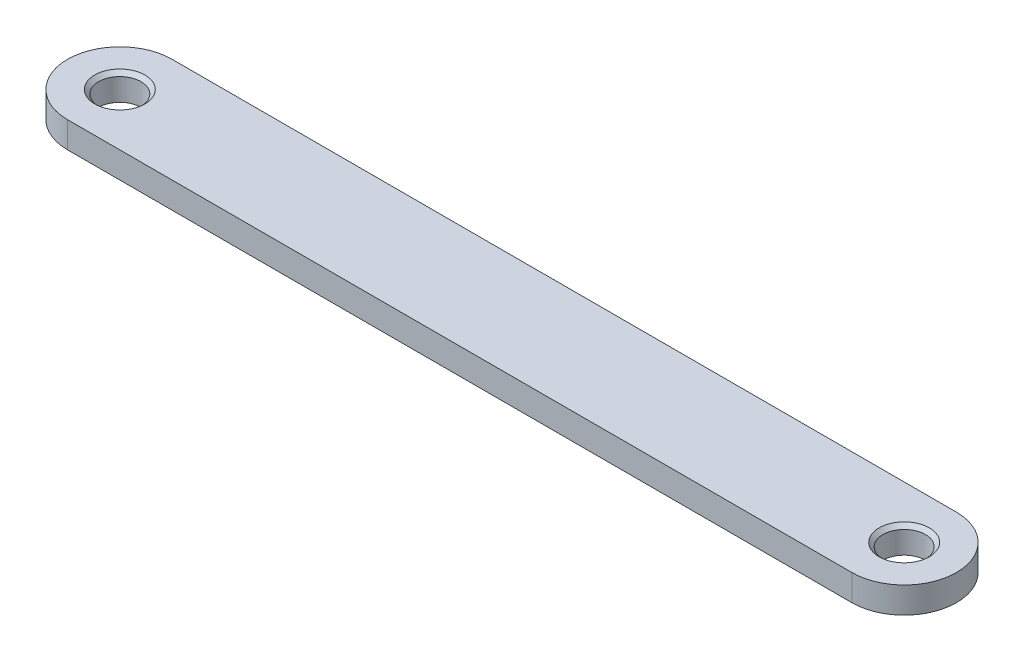
ISO-10303-21;
HEADER;
FILE_DESCRIPTION(('STEP AP214'),'2;1');
FILE_NAME('part.step','',(''),(''),'','','');
FILE_SCHEMA(('AUTOMOTIVE_DESIGN { 1 0 10303 214 1 1 1 1 }'));
ENDSEC;
DATA;
#1=APPLICATION_CONTEXT('core data for automotive mechanical design processes');
#2=APPLICATION_PROTOCOL_DEFINITION('international standard','automotive_design',2000,#1);
#3=PRODUCT_CONTEXT('',#1,'mechanical');
#4=PRODUCT('Part','Part','',(#3));
#5=PRODUCT_RELATED_PRODUCT_CATEGORY('part','',(#4));
#6=PRODUCT_DEFINITION_FORMATION('','',#4);
#7=PRODUCT_DEFINITION_CONTEXT('part definition',#1,'design');
#8=PRODUCT_DEFINITION('design','',#6,#7);
#9=PRODUCT_DEFINITION_SHAPE('','',#8);
#10=(LENGTH_UNIT() NAMED_UNIT(*) SI_UNIT(.MILLI.,.METRE.));
#11=(NAMED_UNIT(*) PLANE_ANGLE_UNIT() SI_UNIT($,.RADIAN.));
#12=(NAMED_UNIT(*) SI_UNIT($,.STERADIAN.) SOLID_ANGLE_UNIT());
#13=UNCERTAINTY_MEASURE_WITH_UNIT(LENGTH_MEASURE(1.E-05),#10,'distance_accuracy_value','');
#14=(GEOMETRIC_REPRESENTATION_CONTEXT(3) GLOBAL_UNCERTAINTY_ASSIGNED_CONTEXT((#13)) GLOBAL_UNIT_ASSIGNED_CONTEXT((#10,
#11,#12)) REPRESENTATION_CONTEXT('',''));
#15=CARTESIAN_POINT('',(0.,0.,0.));
#16=DIRECTION('',(0.,0.,1.));
#17=DIRECTION('',(1.,0.,0.));
#18=AXIS2_PLACEMENT_3D('',#15,#16,#17);
#19=CARTESIAN_POINT('',(-47.625,3.175,0.));
#20=DIRECTION('',(0.,1.,0.));
#21=DIRECTION('',(0.,0.,1.));
#22=AXIS2_PLACEMENT_3D('',#19,#20,#21);
#23=PLANE('',#22);
#24=CARTESIAN_POINT('',(-47.625,3.175,0.));
#25=DIRECTION('',(0.,1.,0.));
#26=DIRECTION('',(0.,0.,1.));
#27=AXIS2_PLACEMENT_3D('',#24,#25,#26);
#28=CIRCLE('',#27,3.048);
#29=CARTESIAN_POINT('',(-47.625,3.175,3.048));
#30=VERTEX_POINT('',#29);
#31=EDGE_CURVE('E146',#30,#30,#28,.T.);
#32=ORIENTED_EDGE('',*,*,#31,.F.);
#33=EDGE_LOOP('',(#32));
#34=FACE_BOUND('',#33,.T.);
#35=CARTESIAN_POINT('',(47.625,3.175,0.));
#36=DIRECTION('',(0.,1.,0.));
#37=DIRECTION('',(0.,0.,1.));
#38=AXIS2_PLACEMENT_3D('',#35,#36,#37);
#39=CIRCLE('',#38,3.048);
#40=CARTESIAN_POINT('',(47.625,3.175,3.048));
#41=VERTEX_POINT('',#40);
#42=EDGE_CURVE('E142',#41,#41,#39,.T.);
#43=ORIENTED_EDGE('',*,*,#42,.F.);
#44=EDGE_LOOP('',(#43));
#45=FACE_BOUND('',#44,.T.);
#46=CARTESIAN_POINT('',(-47.625,3.175,0.));
#47=DIRECTION('',(0.,1.,0.));
#48=DIRECTION('',(0.,0.,1.));
#49=AXIS2_PLACEMENT_3D('',#46,#47,#48);
#50=CIRCLE('',#49,6.35);
#51=CARTESIAN_POINT('',(-47.625,3.175,-6.35));
#52=VERTEX_POINT('',#51);
#53=CARTESIAN_POINT('',(-47.625,3.175,6.35));
#54=VERTEX_POINT('',#53);
#55=EDGE_CURVE('E92',#52,#54,#50,.T.);
#56=ORIENTED_EDGE('',*,*,#55,.T.);
#57=DIRECTION('',(1.,0.,0.));
#58=VECTOR('',#57,1.);
#59=CARTESIAN_POINT('',(-47.625,3.175,6.35));
#60=LINE('',#59,#58);
#61=CARTESIAN_POINT('',(47.625,3.175,6.35));
#62=VERTEX_POINT('',#61);
#63=EDGE_CURVE('E88',#54,#62,#60,.T.);
#64=ORIENTED_EDGE('',*,*,#63,.T.);
#65=CARTESIAN_POINT('',(47.625,3.175,0.));
#66=DIRECTION('',(0.,1.,0.));
#67=DIRECTION('',(0.,0.,1.));
#68=AXIS2_PLACEMENT_3D('',#65,#66,#67);
#69=CIRCLE('',#68,6.35);
#70=CARTESIAN_POINT('',(47.625,3.175,-6.35));
#71=VERTEX_POINT('',#70);
#72=EDGE_CURVE('E90',#62,#71,#69,.T.);
#73=ORIENTED_EDGE('',*,*,#72,.T.);
#74=DIRECTION('',(-1.,0.,0.));
#75=VECTOR('',#74,1.);
#76=CARTESIAN_POINT('',(-47.625,3.175,-6.35));
#77=LINE('',#76,#75);
#78=EDGE_CURVE('E58',#71,#52,#77,.T.);
#79=ORIENTED_EDGE('',*,*,#78,.T.);
#80=EDGE_LOOP('',(#56,#64,#73,#79));
#81=FACE_BOUND('',#80,.T.);
#82=ADVANCED_FACE('F39',(#34,#45,#81),#23,.T.);
#83=CARTESIAN_POINT('',(-47.625,0.,0.));
#84=DIRECTION('',(0.,1.,0.));
#85=DIRECTION('',(0.,0.,1.));
#86=AXIS2_PLACEMENT_3D('',#83,#84,#85);
#87=PLANE('',#86);
#88=CARTESIAN_POINT('',(-47.625,0.,0.));
#89=DIRECTION('',(0.,1.,0.));
#90=DIRECTION('',(0.,0.,1.));
#91=AXIS2_PLACEMENT_3D('',#88,#89,#90);
#92=CIRCLE('',#91,6.35);
#93=CARTESIAN_POINT('',(-47.625,0.,-6.35));
#94=VERTEX_POINT('',#93);
#95=CARTESIAN_POINT('',(-47.625,0.,6.35));
#96=VERTEX_POINT('',#95);
#97=EDGE_CURVE('E109',#94,#96,#92,.T.);
#98=ORIENTED_EDGE('',*,*,#97,.F.);
#99=DIRECTION('',(-1.,0.,0.));
#100=VECTOR('',#99,1.);
#101=CARTESIAN_POINT('',(-47.625,0.,-6.35));
#102=LINE('',#101,#100);
#103=CARTESIAN_POINT('',(47.625,0.,-6.35));
#104=VERTEX_POINT('',#103);
#105=EDGE_CURVE('E81',#104,#94,#102,.T.);
#106=ORIENTED_EDGE('',*,*,#105,.F.);
#107=CARTESIAN_POINT('',(47.625,0.,0.));
#108=DIRECTION('',(0.,1.,0.));
#109=DIRECTION('',(0.,0.,1.));
#110=AXIS2_PLACEMENT_3D('',#107,#108,#109);
#111=CIRCLE('',#110,6.35);
#112=CARTESIAN_POINT('',(47.625,0.,6.35));
#113=VERTEX_POINT('',#112);
#114=EDGE_CURVE('E75',#113,#104,#111,.T.);
#115=ORIENTED_EDGE('',*,*,#114,.F.);
#116=DIRECTION('',(1.,0.,0.));
#117=VECTOR('',#116,1.);
#118=CARTESIAN_POINT('',(-47.625,0.,6.35));
#119=LINE('',#118,#117);
#120=EDGE_CURVE('E97',#96,#113,#119,.T.);
#121=ORIENTED_EDGE('',*,*,#120,.F.);
#122=EDGE_LOOP('',(#98,#106,#115,#121));
#123=FACE_BOUND('',#122,.T.);
#124=CARTESIAN_POINT('',(47.625,0.,0.));
#125=DIRECTION('',(0.,1.,0.));
#126=DIRECTION('',(0.,0.,1.));
#127=AXIS2_PLACEMENT_3D('',#124,#125,#126);
#128=CIRCLE('',#127,2.5796875);
#129=CARTESIAN_POINT('',(47.625,0.,2.5796875));
#130=VERTEX_POINT('',#129);
#131=EDGE_CURVE('E113',#130,#130,#128,.T.);
#132=ORIENTED_EDGE('',*,*,#131,.T.);
#133=EDGE_LOOP('',(#132));
#134=FACE_BOUND('',#133,.T.);
#135=CARTESIAN_POINT('',(-47.625,0.,0.));
#136=DIRECTION('',(0.,1.,0.));
#137=DIRECTION('',(0.,0.,1.));
#138=AXIS2_PLACEMENT_3D('',#135,#136,#137);
#139=CIRCLE('',#138,2.5796875);
#140=CARTESIAN_POINT('',(-47.625,0.,2.5796875));
#141=VERTEX_POINT('',#140);
#142=EDGE_CURVE('E134',#141,#141,#139,.T.);
#143=ORIENTED_EDGE('',*,*,#142,.T.);
#144=EDGE_LOOP('',(#143));
#145=FACE_BOUND('',#144,.T.);
#146=ADVANCED_FACE('F126',(#123,#134,#145),#87,.F.);
#147=CARTESIAN_POINT('',(-47.625,3.175,0.));
#148=DIRECTION('',(0.,-1.,0.));
#149=DIRECTION('',(0.,0.,-1.));
#150=AXIS2_PLACEMENT_3D('',#147,#148,#149);
#151=CYLINDRICAL_SURFACE('',#150,6.35);
#152=ORIENTED_EDGE('',*,*,#97,.T.);
#153=DIRECTION('',(0.,-1.,0.));
#154=VECTOR('',#153,1.);
#155=CARTESIAN_POINT('',(-47.625,3.175,6.35));
#156=LINE('',#155,#154);
#157=EDGE_CURVE('E11',#54,#96,#156,.T.);
#158=ORIENTED_EDGE('',*,*,#157,.F.);
#159=ORIENTED_EDGE('',*,*,#55,.F.);
#160=DIRECTION('',(0.,-1.,0.));
#161=VECTOR('',#160,1.);
#162=CARTESIAN_POINT('',(-47.625,3.175,-6.35));
#163=LINE('',#162,#161);
#164=EDGE_CURVE('E105',#52,#94,#163,.T.);
#165=ORIENTED_EDGE('',*,*,#164,.T.);
#166=EDGE_LOOP('',(#152,#158,#159,#165));
#167=FACE_BOUND('',#166,.T.);
#168=ADVANCED_FACE('F41',(#167),#151,.T.);
#169=CARTESIAN_POINT('',(-47.625,3.175,6.35));
#170=DIRECTION('',(0.,0.,-1.));
#171=DIRECTION('',(-1.,0.,0.));
#172=AXIS2_PLACEMENT_3D('',#169,#170,#171);
#173=PLANE('',#172);
#174=ORIENTED_EDGE('',*,*,#120,.T.);
#175=DIRECTION('',(0.,-1.,0.));
#176=VECTOR('',#175,1.);
#177=CARTESIAN_POINT('',(47.625,3.175,6.35));
#178=LINE('',#177,#176);
#179=EDGE_CURVE('E50',#62,#113,#178,.T.);
#180=ORIENTED_EDGE('',*,*,#179,.F.);
#181=ORIENTED_EDGE('',*,*,#63,.F.);
#182=ORIENTED_EDGE('',*,*,#157,.T.);
#183=EDGE_LOOP('',(#174,#180,#181,#182));
#184=FACE_BOUND('',#183,.T.);
#185=ADVANCED_FACE('F96',(#184),#173,.F.);
#186=CARTESIAN_POINT('',(47.625,3.175,0.));
#187=DIRECTION('',(0.,-1.,0.));
#188=DIRECTION('',(0.,0.,-1.));
#189=AXIS2_PLACEMENT_3D('',#186,#187,#188);
#190=CYLINDRICAL_SURFACE('',#189,6.35);
#191=ORIENTED_EDGE('',*,*,#114,.T.);
#192=DIRECTION('',(0.,-1.,0.));
#193=VECTOR('',#192,1.);
#194=CARTESIAN_POINT('',(47.625,3.175,-6.35));
#195=LINE('',#194,#193);
#196=EDGE_CURVE('E99',#71,#104,#195,.T.);
#197=ORIENTED_EDGE('',*,*,#196,.F.);
#198=ORIENTED_EDGE('',*,*,#72,.F.);
#199=ORIENTED_EDGE('',*,*,#179,.T.);
#200=EDGE_LOOP('',(#191,#197,#198,#199));
#201=FACE_BOUND('',#200,.T.);
#202=ADVANCED_FACE('F101',(#201),#190,.T.);
#203=CARTESIAN_POINT('',(-47.625,3.175,-6.35));
#204=DIRECTION('',(0.,0.,1.));
#205=DIRECTION('',(1.,0.,0.));
#206=AXIS2_PLACEMENT_3D('',#203,#204,#205);
#207=PLANE('',#206);
#208=ORIENTED_EDGE('',*,*,#105,.T.);
#209=ORIENTED_EDGE('',*,*,#164,.F.);
#210=ORIENTED_EDGE('',*,*,#78,.F.);
#211=ORIENTED_EDGE('',*,*,#196,.T.);
#212=EDGE_LOOP('',(#208,#209,#210,#211));
#213=FACE_BOUND('',#212,.T.);
#214=ADVANCED_FACE('F123',(#213),#207,.F.);
#215=CARTESIAN_POINT('',(47.625,3.175,0.));
#216=DIRECTION('',(0.,-1.,0.));
#217=DIRECTION('',(0.,0.,-1.));
#218=AXIS2_PLACEMENT_3D('',#215,#216,#217);
#219=CYLINDRICAL_SURFACE('',#218,2.5796875);
#220=CARTESIAN_POINT('',(47.625,2.7066875,0.));
#221=DIRECTION('',(0.,1.,0.));
#222=DIRECTION('',(0.,0.,1.));
#223=AXIS2_PLACEMENT_3D('',#220,#221,#222);
#224=CIRCLE('',#223,2.5796875);
#225=CARTESIAN_POINT('',(47.625,2.7066875,2.5796875));
#226=VERTEX_POINT('',#225);
#227=EDGE_CURVE('E138',#226,#226,#224,.F.);
#228=ORIENTED_EDGE('',*,*,#227,.F.);
#229=EDGE_LOOP('',(#228));
#230=FACE_BOUND('',#229,.T.);
#231=ORIENTED_EDGE('',*,*,#131,.F.);
#232=EDGE_LOOP('',(#231));
#233=FACE_BOUND('',#232,.T.);
#234=ADVANCED_FACE('F161',(#230,#233),#219,.F.);
#235=CARTESIAN_POINT('',(-47.625,3.175,0.));
#236=DIRECTION('',(0.,-1.,0.));
#237=DIRECTION('',(0.,0.,-1.));
#238=AXIS2_PLACEMENT_3D('',#235,#236,#237);
#239=CYLINDRICAL_SURFACE('',#238,2.5796875);
#240=CARTESIAN_POINT('',(-47.625,2.7066875,0.));
#241=DIRECTION('',(0.,1.,0.));
#242=DIRECTION('',(0.,0.,1.));
#243=AXIS2_PLACEMENT_3D('',#240,#241,#242);
#244=CIRCLE('',#243,2.5796875);
#245=CARTESIAN_POINT('',(-47.625,2.7066875,2.5796875));
#246=VERTEX_POINT('',#245);
#247=EDGE_CURVE('E43',#246,#246,#244,.F.);
#248=ORIENTED_EDGE('',*,*,#247,.F.);
#249=EDGE_LOOP('',(#248));
#250=FACE_BOUND('',#249,.T.);
#251=ORIENTED_EDGE('',*,*,#142,.F.);
#252=EDGE_LOOP('',(#251));
#253=FACE_BOUND('',#252,.T.);
#254=ADVANCED_FACE('F157',(#250,#253),#239,.F.);
#255=CARTESIAN_POINT('',(47.625,3.175,0.));
#256=DIRECTION('',(0.,1.,0.));
#257=DIRECTION('',(0.,0.,1.));
#258=AXIS2_PLACEMENT_3D('',#255,#256,#257);
#259=CONICAL_SURFACE('',#258,3.048,0.785398163397451);
#260=ORIENTED_EDGE('',*,*,#227,.T.);
#261=EDGE_LOOP('',(#260));
#262=FACE_BOUND('',#261,.T.);
#263=ORIENTED_EDGE('',*,*,#42,.T.);
#264=EDGE_LOOP('',(#263));
#265=FACE_BOUND('',#264,.T.);
#266=ADVANCED_FACE('F160',(#262,#265),#259,.F.);
#267=CARTESIAN_POINT('',(-47.625,3.175,0.));
#268=DIRECTION('',(0.,1.,0.));
#269=DIRECTION('',(0.,0.,1.));
#270=AXIS2_PLACEMENT_3D('',#267,#268,#269);
#271=CONICAL_SURFACE('',#270,3.048,0.785398163397451);
#272=ORIENTED_EDGE('',*,*,#247,.T.);
#273=EDGE_LOOP('',(#272));
#274=FACE_BOUND('',#273,.T.);
#275=ORIENTED_EDGE('',*,*,#31,.T.);
#276=EDGE_LOOP('',(#275));
#277=FACE_BOUND('',#276,.T.);
#278=ADVANCED_FACE('F155',(#274,#277),#271,.F.);
#279=CLOSED_SHELL('',(#82,#146,#168,#185,#202,#214,#234,#254,#266,#278));
#280=MANIFOLD_SOLID_BREP('B2',#279);
#281=ADVANCED_BREP_SHAPE_REPRESENTATION('',(#18,#280),#14);
#282=SHAPE_DEFINITION_REPRESENTATION(#9,#281);
ENDSEC;
END-ISO-10303-21;
